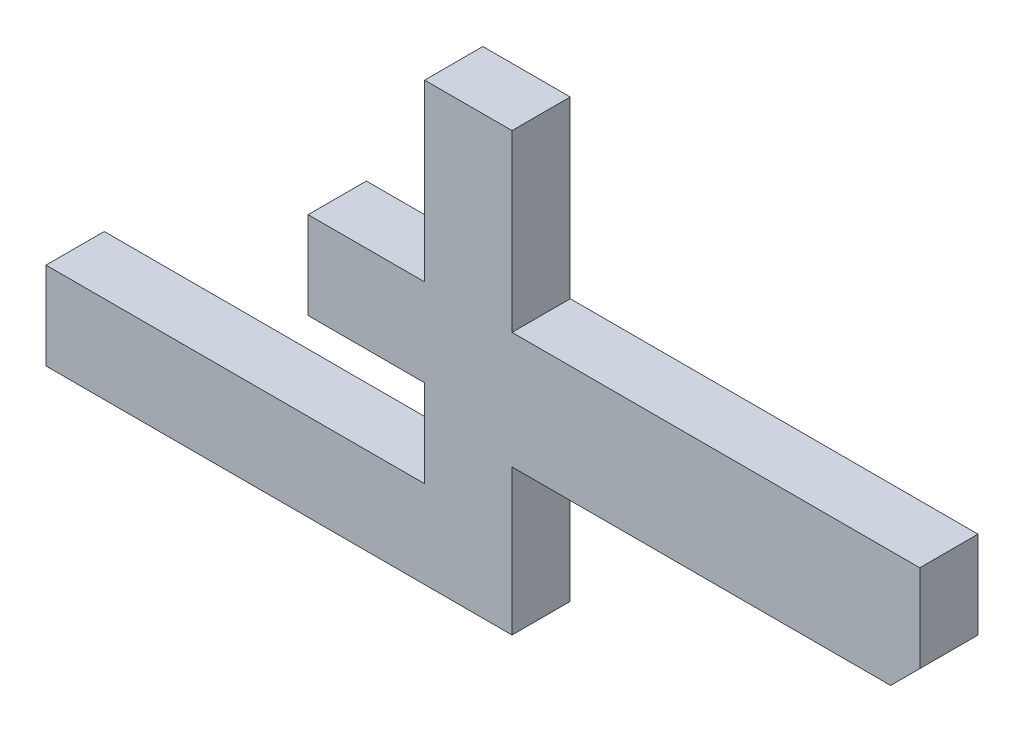
ISO-10303-21;
HEADER;
FILE_DESCRIPTION(('STEP AP214'),'2;1');
FILE_NAME('part.step','',(''),(''),'','','');
FILE_SCHEMA(('AUTOMOTIVE_DESIGN { 1 0 10303 214 1 1 1 1 }'));
ENDSEC;
DATA;
#1=APPLICATION_CONTEXT('core data for automotive mechanical design processes');
#2=APPLICATION_PROTOCOL_DEFINITION('international standard','automotive_design',2000,#1);
#3=PRODUCT_CONTEXT('',#1,'mechanical');
#4=PRODUCT('Part','Part','',(#3));
#5=PRODUCT_RELATED_PRODUCT_CATEGORY('part','',(#4));
#6=PRODUCT_DEFINITION_FORMATION('','',#4);
#7=PRODUCT_DEFINITION_CONTEXT('part definition',#1,'design');
#8=PRODUCT_DEFINITION('design','',#6,#7);
#9=PRODUCT_DEFINITION_SHAPE('','',#8);
#10=(LENGTH_UNIT() NAMED_UNIT(*) SI_UNIT(.MILLI.,.METRE.));
#11=(NAMED_UNIT(*) PLANE_ANGLE_UNIT() SI_UNIT($,.RADIAN.));
#12=(NAMED_UNIT(*) SI_UNIT($,.STERADIAN.) SOLID_ANGLE_UNIT());
#13=UNCERTAINTY_MEASURE_WITH_UNIT(LENGTH_MEASURE(1.E-05),#10,'distance_accuracy_value','');
#14=(GEOMETRIC_REPRESENTATION_CONTEXT(3) GLOBAL_UNCERTAINTY_ASSIGNED_CONTEXT((#13)) GLOBAL_UNIT_ASSIGNED_CONTEXT((#10,
#11,#12)) REPRESENTATION_CONTEXT('',''));
#15=CARTESIAN_POINT('',(0.,0.,0.));
#16=DIRECTION('',(0.,0.,1.));
#17=DIRECTION('',(1.,0.,0.));
#18=AXIS2_PLACEMENT_3D('',#15,#16,#17);
#19=CARTESIAN_POINT('',(-0.1905,-0.09525000000002,0.0254));
#20=DIRECTION('',(0.,0.,1.));
#21=DIRECTION('',(1.,0.,0.));
#22=AXIS2_PLACEMENT_3D('',#19,#20,#21);
#23=PLANE('',#22);
#24=DIRECTION('',(1.,0.,0.));
#25=VECTOR('',#24,1.);
#26=CARTESIAN_POINT('',(-0.1905,-0.05715000000001,0.0254));
#27=LINE('',#26,#25);
#28=CARTESIAN_POINT('',(-0.1905,-0.05715000000001,0.0254));
#29=VERTEX_POINT('',#28);
#30=CARTESIAN_POINT('',(-0.0254,-0.05715000000001,0.0254));
#31=VERTEX_POINT('',#30);
#32=EDGE_CURVE('E187',#29,#31,#27,.T.);
#33=ORIENTED_EDGE('',*,*,#32,.F.);
#34=DIRECTION('',(0.,1.,0.));
#35=VECTOR('',#34,1.);
#36=CARTESIAN_POINT('',(-0.1905,-0.09525000000002,0.0254));
#37=LINE('',#36,#35);
#38=CARTESIAN_POINT('',(-0.1905,-0.09525000000002,0.0254));
#39=VERTEX_POINT('',#38);
#40=EDGE_CURVE('E136',#39,#29,#37,.T.);
#41=ORIENTED_EDGE('',*,*,#40,.F.);
#42=DIRECTION('',(1.,0.,0.));
#43=VECTOR('',#42,1.);
#44=CARTESIAN_POINT('',(0.0127,-0.09525000000002,0.0254));
#45=LINE('',#44,#43);
#46=CARTESIAN_POINT('',(0.0127,-0.09525000000002,0.0254));
#47=VERTEX_POINT('',#46);
#48=EDGE_CURVE('E20',#47,#39,#45,.F.);
#49=ORIENTED_EDGE('',*,*,#48,.F.);
#50=DIRECTION('',(0.,1.,0.));
#51=VECTOR('',#50,1.);
#52=CARTESIAN_POINT('',(0.0127,-0.03175000000002,0.0254));
#53=LINE('',#52,#51);
#54=CARTESIAN_POINT('',(0.0127,-0.03175000000002,0.0254));
#55=VERTEX_POINT('',#54);
#56=EDGE_CURVE('E125',#55,#47,#53,.F.);
#57=ORIENTED_EDGE('',*,*,#56,.F.);
#58=DIRECTION('',(1.,0.,0.));
#59=VECTOR('',#58,1.);
#60=CARTESIAN_POINT('',(0.1778,-0.03175000000002,0.0254));
#61=LINE('',#60,#59);
#62=CARTESIAN_POINT('',(0.1778,-0.03175000000002,0.0254));
#63=VERTEX_POINT('',#62);
#64=EDGE_CURVE('E120',#63,#55,#61,.F.);
#65=ORIENTED_EDGE('',*,*,#64,.F.);
#66=DIRECTION('',(0.707106781186548,0.707106781186548,0.));
#67=VECTOR('',#66,1.);
#68=CARTESIAN_POINT('',(0.1905,-0.01905000000002,0.0254));
#69=LINE('',#68,#67);
#70=CARTESIAN_POINT('',(0.1905,-0.01905000000002,0.0254));
#71=VERTEX_POINT('',#70);
#72=EDGE_CURVE('E147',#71,#63,#69,.F.);
#73=ORIENTED_EDGE('',*,*,#72,.F.);
#74=DIRECTION('',(0.,1.,0.));
#75=VECTOR('',#74,1.);
#76=CARTESIAN_POINT('',(0.1905,0.01904999999999,0.0254));
#77=LINE('',#76,#75);
#78=CARTESIAN_POINT('',(0.1905,0.01904999999999,0.0254));
#79=VERTEX_POINT('',#78);
#80=EDGE_CURVE('E151',#79,#71,#77,.F.);
#81=ORIENTED_EDGE('',*,*,#80,.F.);
#82=DIRECTION('',(1.,0.,0.));
#83=VECTOR('',#82,1.);
#84=CARTESIAN_POINT('',(0.0127,0.01904999999999,0.0254));
#85=LINE('',#84,#83);
#86=CARTESIAN_POINT('',(0.0127,0.01904999999999,0.0254));
#87=VERTEX_POINT('',#86);
#88=EDGE_CURVE('E155',#87,#79,#85,.T.);
#89=ORIENTED_EDGE('',*,*,#88,.F.);
#90=DIRECTION('',(0.,1.,0.));
#91=VECTOR('',#90,1.);
#92=CARTESIAN_POINT('',(0.0127,0.09524999999999,0.0254));
#93=LINE('',#92,#91);
#94=CARTESIAN_POINT('',(0.0127,0.09524999999999,0.0254));
#95=VERTEX_POINT('',#94);
#96=EDGE_CURVE('E159',#95,#87,#93,.F.);
#97=ORIENTED_EDGE('',*,*,#96,.F.);
#98=DIRECTION('',(1.,0.,0.));
#99=VECTOR('',#98,1.);
#100=CARTESIAN_POINT('',(-0.0254,0.09524999999999,0.0254));
#101=LINE('',#100,#99);
#102=CARTESIAN_POINT('',(-0.0254,0.09524999999999,0.0254));
#103=VERTEX_POINT('',#102);
#104=EDGE_CURVE('E163',#103,#95,#101,.T.);
#105=ORIENTED_EDGE('',*,*,#104,.F.);
#106=DIRECTION('',(0.,1.,0.));
#107=VECTOR('',#106,1.);
#108=CARTESIAN_POINT('',(-0.0254,0.01904999999999,0.0254));
#109=LINE('',#108,#107);
#110=CARTESIAN_POINT('',(-0.0254,0.01904999999999,0.0254));
#111=VERTEX_POINT('',#110);
#112=EDGE_CURVE('E167',#111,#103,#109,.T.);
#113=ORIENTED_EDGE('',*,*,#112,.F.);
#114=DIRECTION('',(1.,0.,0.));
#115=VECTOR('',#114,1.);
#116=CARTESIAN_POINT('',(-0.0762,0.01904999999999,0.0254));
#117=LINE('',#116,#115);
#118=CARTESIAN_POINT('',(-0.0762,0.01904999999999,0.0254));
#119=VERTEX_POINT('',#118);
#120=EDGE_CURVE('E171',#119,#111,#117,.T.);
#121=ORIENTED_EDGE('',*,*,#120,.F.);
#122=DIRECTION('',(0.,1.,0.));
#123=VECTOR('',#122,1.);
#124=CARTESIAN_POINT('',(-0.0762,-0.01905000000002,0.0254));
#125=LINE('',#124,#123);
#126=CARTESIAN_POINT('',(-0.0762,-0.01905000000002,0.0254));
#127=VERTEX_POINT('',#126);
#128=EDGE_CURVE('E175',#127,#119,#125,.T.);
#129=ORIENTED_EDGE('',*,*,#128,.F.);
#130=DIRECTION('',(1.,0.,0.));
#131=VECTOR('',#130,1.);
#132=CARTESIAN_POINT('',(-0.0254,-0.01905000000002,0.0254));
#133=LINE('',#132,#131);
#134=CARTESIAN_POINT('',(-0.0254,-0.01905000000002,0.0254));
#135=VERTEX_POINT('',#134);
#136=EDGE_CURVE('E179',#135,#127,#133,.F.);
#137=ORIENTED_EDGE('',*,*,#136,.F.);
#138=DIRECTION('',(0.,1.,0.));
#139=VECTOR('',#138,1.);
#140=CARTESIAN_POINT('',(-0.0254,-0.05715000000001,0.0254));
#141=LINE('',#140,#139);
#142=EDGE_CURVE('E183',#31,#135,#141,.T.);
#143=ORIENTED_EDGE('',*,*,#142,.F.);
#144=EDGE_LOOP('',(#33,#41,#49,#57,#65,#73,#81,#89,#97,#105,#113,#121,#129,#137,#143));
#145=FACE_BOUND('',#144,.T.);
#146=ADVANCED_FACE('F17',(#145),#23,.T.);
#147=CARTESIAN_POINT('',(0.0127,-0.09525000000002,0.));
#148=DIRECTION('',(0.,-1.,0.));
#149=DIRECTION('',(0.,0.,-1.));
#150=AXIS2_PLACEMENT_3D('',#147,#148,#149);
#151=PLANE('',#150);
#152=DIRECTION('',(0.,0.,1.));
#153=VECTOR('',#152,1.);
#154=CARTESIAN_POINT('',(-0.1905,-0.09525000000002,0.));
#155=LINE('',#154,#153);
#156=CARTESIAN_POINT('',(-0.1905,-0.09525000000002,0.));
#157=VERTEX_POINT('',#156);
#158=EDGE_CURVE('E191',#157,#39,#155,.T.);
#159=ORIENTED_EDGE('',*,*,#158,.F.);
#160=DIRECTION('',(1.,0.,0.));
#161=VECTOR('',#160,1.);
#162=CARTESIAN_POINT('',(-0.1905,-0.09525000000002,0.));
#163=LINE('',#162,#161);
#164=CARTESIAN_POINT('',(0.0127,-0.09525000000002,0.));
#165=VERTEX_POINT('',#164);
#166=EDGE_CURVE('E142',#157,#165,#163,.T.);
#167=ORIENTED_EDGE('',*,*,#166,.T.);
#168=DIRECTION('',(0.,0.,-1.));
#169=VECTOR('',#168,1.);
#170=CARTESIAN_POINT('',(0.0127,-0.09525000000002,0.));
#171=LINE('',#170,#169);
#172=EDGE_CURVE('E130',#47,#165,#171,.T.);
#173=ORIENTED_EDGE('',*,*,#172,.F.);
#174=ORIENTED_EDGE('',*,*,#48,.T.);
#175=EDGE_LOOP('',(#159,#167,#173,#174));
#176=FACE_BOUND('',#175,.T.);
#177=ADVANCED_FACE('F141',(#176),#151,.T.);
#178=CARTESIAN_POINT('',(0.0127,-0.03175000000002,0.));
#179=DIRECTION('',(1.,0.,0.));
#180=DIRECTION('',(0.,0.,-1.));
#181=AXIS2_PLACEMENT_3D('',#178,#179,#180);
#182=PLANE('',#181);
#183=ORIENTED_EDGE('',*,*,#172,.T.);
#184=DIRECTION('',(0.,1.,0.));
#185=VECTOR('',#184,1.);
#186=CARTESIAN_POINT('',(0.0127,-0.09525000000002,0.));
#187=LINE('',#186,#185);
#188=CARTESIAN_POINT('',(0.0127,-0.03175000000002,0.));
#189=VERTEX_POINT('',#188);
#190=EDGE_CURVE('E196',#165,#189,#187,.T.);
#191=ORIENTED_EDGE('',*,*,#190,.T.);
#192=DIRECTION('',(0.,0.,-1.));
#193=VECTOR('',#192,1.);
#194=CARTESIAN_POINT('',(0.0127,-0.03175000000002,0.));
#195=LINE('',#194,#193);
#196=EDGE_CURVE('E132',#55,#189,#195,.T.);
#197=ORIENTED_EDGE('',*,*,#196,.F.);
#198=ORIENTED_EDGE('',*,*,#56,.T.);
#199=EDGE_LOOP('',(#183,#191,#197,#198));
#200=FACE_BOUND('',#199,.T.);
#201=ADVANCED_FACE('F127',(#200),#182,.T.);
#202=CARTESIAN_POINT('',(0.1778,-0.03175000000002,0.));
#203=DIRECTION('',(0.,-1.,0.));
#204=DIRECTION('',(0.,0.,-1.));
#205=AXIS2_PLACEMENT_3D('',#202,#203,#204);
#206=PLANE('',#205);
#207=ORIENTED_EDGE('',*,*,#196,.T.);
#208=DIRECTION('',(1.,0.,0.));
#209=VECTOR('',#208,1.);
#210=CARTESIAN_POINT('',(-0.1905,-0.03175000000002,0.));
#211=LINE('',#210,#209);
#212=CARTESIAN_POINT('',(0.1778,-0.03175000000002,0.));
#213=VERTEX_POINT('',#212);
#214=EDGE_CURVE('E198',#189,#213,#211,.T.);
#215=ORIENTED_EDGE('',*,*,#214,.T.);
#216=DIRECTION('',(0.,0.,1.));
#217=VECTOR('',#216,1.);
#218=CARTESIAN_POINT('',(0.1778,-0.03175000000002,0.));
#219=LINE('',#218,#217);
#220=EDGE_CURVE('E149',#63,#213,#219,.F.);
#221=ORIENTED_EDGE('',*,*,#220,.F.);
#222=ORIENTED_EDGE('',*,*,#64,.T.);
#223=EDGE_LOOP('',(#207,#215,#221,#222));
#224=FACE_BOUND('',#223,.T.);
#225=ADVANCED_FACE('F288',(#224),#206,.T.);
#226=CARTESIAN_POINT('',(0.1905,-0.01905000000002,0.));
#227=DIRECTION('',(0.707106781186548,-0.707106781186548,0.));
#228=DIRECTION('',(0.707106781186548,0.707106781186548,0.));
#229=AXIS2_PLACEMENT_3D('',#226,#227,#228);
#230=PLANE('',#229);
#231=ORIENTED_EDGE('',*,*,#220,.T.);
#232=DIRECTION('',(0.707106781186547,0.707106781186548,0.));
#233=VECTOR('',#232,1.);
#234=CARTESIAN_POINT('',(0.1778,-0.03175000000002,0.));
#235=LINE('',#234,#233);
#236=CARTESIAN_POINT('',(0.1905,-0.01905000000002,0.));
#237=VERTEX_POINT('',#236);
#238=EDGE_CURVE('E201',#213,#237,#235,.T.);
#239=ORIENTED_EDGE('',*,*,#238,.T.);
#240=DIRECTION('',(0.,0.,-1.));
#241=VECTOR('',#240,1.);
#242=CARTESIAN_POINT('',(0.1905,-0.01905000000002,0.));
#243=LINE('',#242,#241);
#244=EDGE_CURVE('E153',#71,#237,#243,.T.);
#245=ORIENTED_EDGE('',*,*,#244,.F.);
#246=ORIENTED_EDGE('',*,*,#72,.T.);
#247=EDGE_LOOP('',(#231,#239,#245,#246));
#248=FACE_BOUND('',#247,.T.);
#249=ADVANCED_FACE('F286',(#248),#230,.T.);
#250=CARTESIAN_POINT('',(0.1905,0.01904999999999,0.));
#251=DIRECTION('',(1.,0.,0.));
#252=DIRECTION('',(0.,0.,-1.));
#253=AXIS2_PLACEMENT_3D('',#250,#251,#252);
#254=PLANE('',#253);
#255=ORIENTED_EDGE('',*,*,#244,.T.);
#256=DIRECTION('',(0.,1.,0.));
#257=VECTOR('',#256,1.);
#258=CARTESIAN_POINT('',(0.1905,-0.09525000000002,0.));
#259=LINE('',#258,#257);
#260=CARTESIAN_POINT('',(0.1905,0.01904999999999,0.));
#261=VERTEX_POINT('',#260);
#262=EDGE_CURVE('E204',#237,#261,#259,.T.);
#263=ORIENTED_EDGE('',*,*,#262,.T.);
#264=DIRECTION('',(0.,0.,1.));
#265=VECTOR('',#264,1.);
#266=CARTESIAN_POINT('',(0.1905,0.01904999999999,0.));
#267=LINE('',#266,#265);
#268=EDGE_CURVE('E157',#79,#261,#267,.F.);
#269=ORIENTED_EDGE('',*,*,#268,.F.);
#270=ORIENTED_EDGE('',*,*,#80,.T.);
#271=EDGE_LOOP('',(#255,#263,#269,#270));
#272=FACE_BOUND('',#271,.T.);
#273=ADVANCED_FACE('F282',(#272),#254,.T.);
#274=CARTESIAN_POINT('',(0.0127,0.01904999999999,0.));
#275=DIRECTION('',(0.,1.,0.));
#276=DIRECTION('',(0.,0.,1.));
#277=AXIS2_PLACEMENT_3D('',#274,#275,#276);
#278=PLANE('',#277);
#279=ORIENTED_EDGE('',*,*,#268,.T.);
#280=DIRECTION('',(1.,0.,0.));
#281=VECTOR('',#280,1.);
#282=CARTESIAN_POINT('',(-0.1905,0.01904999999999,0.));
#283=LINE('',#282,#281);
#284=CARTESIAN_POINT('',(0.0127,0.01904999999999,0.));
#285=VERTEX_POINT('',#284);
#286=EDGE_CURVE('E207',#261,#285,#283,.F.);
#287=ORIENTED_EDGE('',*,*,#286,.T.);
#288=DIRECTION('',(0.,0.,-1.));
#289=VECTOR('',#288,1.);
#290=CARTESIAN_POINT('',(0.0127,0.01904999999999,0.));
#291=LINE('',#290,#289);
#292=EDGE_CURVE('E161',#87,#285,#291,.T.);
#293=ORIENTED_EDGE('',*,*,#292,.F.);
#294=ORIENTED_EDGE('',*,*,#88,.T.);
#295=EDGE_LOOP('',(#279,#287,#293,#294));
#296=FACE_BOUND('',#295,.T.);
#297=ADVANCED_FACE('F276',(#296),#278,.T.);
#298=CARTESIAN_POINT('',(0.0127,0.09524999999999,0.));
#299=DIRECTION('',(1.,0.,0.));
#300=DIRECTION('',(0.,0.,-1.));
#301=AXIS2_PLACEMENT_3D('',#298,#299,#300);
#302=PLANE('',#301);
#303=ORIENTED_EDGE('',*,*,#292,.T.);
#304=DIRECTION('',(0.,1.,0.));
#305=VECTOR('',#304,1.);
#306=CARTESIAN_POINT('',(0.0127,-0.09525000000002,0.));
#307=LINE('',#306,#305);
#308=CARTESIAN_POINT('',(0.0127,0.09524999999999,0.));
#309=VERTEX_POINT('',#308);
#310=EDGE_CURVE('E210',#285,#309,#307,.T.);
#311=ORIENTED_EDGE('',*,*,#310,.T.);
#312=DIRECTION('',(0.,0.,1.));
#313=VECTOR('',#312,1.);
#314=CARTESIAN_POINT('',(0.0127,0.09524999999999,0.));
#315=LINE('',#314,#313);
#316=EDGE_CURVE('E165',#95,#309,#315,.F.);
#317=ORIENTED_EDGE('',*,*,#316,.F.);
#318=ORIENTED_EDGE('',*,*,#96,.T.);
#319=EDGE_LOOP('',(#303,#311,#317,#318));
#320=FACE_BOUND('',#319,.T.);
#321=ADVANCED_FACE('F272',(#320),#302,.T.);
#322=CARTESIAN_POINT('',(-0.0254,0.09524999999999,0.));
#323=DIRECTION('',(0.,1.,0.));
#324=DIRECTION('',(0.,0.,1.));
#325=AXIS2_PLACEMENT_3D('',#322,#323,#324);
#326=PLANE('',#325);
#327=ORIENTED_EDGE('',*,*,#316,.T.);
#328=DIRECTION('',(1.,0.,0.));
#329=VECTOR('',#328,1.);
#330=CARTESIAN_POINT('',(-0.1905,0.09524999999999,0.));
#331=LINE('',#330,#329);
#332=CARTESIAN_POINT('',(-0.0254,0.09524999999999,0.));
#333=VERTEX_POINT('',#332);
#334=EDGE_CURVE('E213',#309,#333,#331,.F.);
#335=ORIENTED_EDGE('',*,*,#334,.T.);
#336=DIRECTION('',(0.,0.,1.));
#337=VECTOR('',#336,1.);
#338=CARTESIAN_POINT('',(-0.0254,0.09524999999999,0.));
#339=LINE('',#338,#337);
#340=EDGE_CURVE('E169',#103,#333,#339,.F.);
#341=ORIENTED_EDGE('',*,*,#340,.F.);
#342=ORIENTED_EDGE('',*,*,#104,.T.);
#343=EDGE_LOOP('',(#327,#335,#341,#342));
#344=FACE_BOUND('',#343,.T.);
#345=ADVANCED_FACE('F266',(#344),#326,.T.);
#346=CARTESIAN_POINT('',(-0.0254,0.01904999999999,0.));
#347=DIRECTION('',(-1.,0.,0.));
#348=DIRECTION('',(0.,0.,1.));
#349=AXIS2_PLACEMENT_3D('',#346,#347,#348);
#350=PLANE('',#349);
#351=ORIENTED_EDGE('',*,*,#340,.T.);
#352=DIRECTION('',(0.,1.,0.));
#353=VECTOR('',#352,1.);
#354=CARTESIAN_POINT('',(-0.0254,-0.09525000000002,0.));
#355=LINE('',#354,#353);
#356=CARTESIAN_POINT('',(-0.0254,0.01904999999999,0.));
#357=VERTEX_POINT('',#356);
#358=EDGE_CURVE('E216',#333,#357,#355,.F.);
#359=ORIENTED_EDGE('',*,*,#358,.T.);
#360=DIRECTION('',(0.,0.,1.));
#361=VECTOR('',#360,1.);
#362=CARTESIAN_POINT('',(-0.0254,0.01904999999999,0.));
#363=LINE('',#362,#361);
#364=EDGE_CURVE('E173',#111,#357,#363,.F.);
#365=ORIENTED_EDGE('',*,*,#364,.F.);
#366=ORIENTED_EDGE('',*,*,#112,.T.);
#367=EDGE_LOOP('',(#351,#359,#365,#366));
#368=FACE_BOUND('',#367,.T.);
#369=ADVANCED_FACE('F262',(#368),#350,.T.);
#370=CARTESIAN_POINT('',(-0.0762,0.01904999999999,0.));
#371=DIRECTION('',(0.,1.,0.));
#372=DIRECTION('',(0.,0.,1.));
#373=AXIS2_PLACEMENT_3D('',#370,#371,#372);
#374=PLANE('',#373);
#375=ORIENTED_EDGE('',*,*,#364,.T.);
#376=DIRECTION('',(1.,0.,0.));
#377=VECTOR('',#376,1.);
#378=CARTESIAN_POINT('',(-0.1905,0.01904999999999,0.));
#379=LINE('',#378,#377);
#380=CARTESIAN_POINT('',(-0.0762,0.01904999999999,0.));
#381=VERTEX_POINT('',#380);
#382=EDGE_CURVE('E219',#357,#381,#379,.F.);
#383=ORIENTED_EDGE('',*,*,#382,.T.);
#384=DIRECTION('',(0.,0.,1.));
#385=VECTOR('',#384,1.);
#386=CARTESIAN_POINT('',(-0.0762,0.01904999999999,0.));
#387=LINE('',#386,#385);
#388=EDGE_CURVE('E177',#119,#381,#387,.F.);
#389=ORIENTED_EDGE('',*,*,#388,.F.);
#390=ORIENTED_EDGE('',*,*,#120,.T.);
#391=EDGE_LOOP('',(#375,#383,#389,#390));
#392=FACE_BOUND('',#391,.T.);
#393=ADVANCED_FACE('F256',(#392),#374,.T.);
#394=CARTESIAN_POINT('',(-0.0762,-0.01905000000002,0.));
#395=DIRECTION('',(-1.,0.,0.));
#396=DIRECTION('',(0.,0.,1.));
#397=AXIS2_PLACEMENT_3D('',#394,#395,#396);
#398=PLANE('',#397);
#399=ORIENTED_EDGE('',*,*,#388,.T.);
#400=DIRECTION('',(0.,1.,0.));
#401=VECTOR('',#400,1.);
#402=CARTESIAN_POINT('',(-0.0762,-0.09525000000002,0.));
#403=LINE('',#402,#401);
#404=CARTESIAN_POINT('',(-0.0762,-0.01905000000002,0.));
#405=VERTEX_POINT('',#404);
#406=EDGE_CURVE('E222',#381,#405,#403,.F.);
#407=ORIENTED_EDGE('',*,*,#406,.T.);
#408=DIRECTION('',(0.,0.,-1.));
#409=VECTOR('',#408,1.);
#410=CARTESIAN_POINT('',(-0.0762,-0.01905000000002,0.));
#411=LINE('',#410,#409);
#412=EDGE_CURVE('E181',#127,#405,#411,.T.);
#413=ORIENTED_EDGE('',*,*,#412,.F.);
#414=ORIENTED_EDGE('',*,*,#128,.T.);
#415=EDGE_LOOP('',(#399,#407,#413,#414));
#416=FACE_BOUND('',#415,.T.);
#417=ADVANCED_FACE('F252',(#416),#398,.T.);
#418=CARTESIAN_POINT('',(-0.0254,-0.01905000000002,0.));
#419=DIRECTION('',(0.,-1.,0.));
#420=DIRECTION('',(0.,0.,-1.));
#421=AXIS2_PLACEMENT_3D('',#418,#419,#420);
#422=PLANE('',#421);
#423=ORIENTED_EDGE('',*,*,#412,.T.);
#424=DIRECTION('',(1.,0.,0.));
#425=VECTOR('',#424,1.);
#426=CARTESIAN_POINT('',(-0.1905,-0.01905000000002,0.));
#427=LINE('',#426,#425);
#428=CARTESIAN_POINT('',(-0.0254,-0.01905000000002,0.));
#429=VERTEX_POINT('',#428);
#430=EDGE_CURVE('E225',#405,#429,#427,.T.);
#431=ORIENTED_EDGE('',*,*,#430,.T.);
#432=DIRECTION('',(0.,0.,1.));
#433=VECTOR('',#432,1.);
#434=CARTESIAN_POINT('',(-0.0254,-0.01905000000002,0.));
#435=LINE('',#434,#433);
#436=EDGE_CURVE('E185',#135,#429,#435,.F.);
#437=ORIENTED_EDGE('',*,*,#436,.F.);
#438=ORIENTED_EDGE('',*,*,#136,.T.);
#439=EDGE_LOOP('',(#423,#431,#437,#438));
#440=FACE_BOUND('',#439,.T.);
#441=ADVANCED_FACE('F246',(#440),#422,.T.);
#442=CARTESIAN_POINT('',(-0.0254,-0.05715000000001,0.));
#443=DIRECTION('',(-1.,0.,0.));
#444=DIRECTION('',(0.,0.,1.));
#445=AXIS2_PLACEMENT_3D('',#442,#443,#444);
#446=PLANE('',#445);
#447=ORIENTED_EDGE('',*,*,#436,.T.);
#448=DIRECTION('',(0.,1.,0.));
#449=VECTOR('',#448,1.);
#450=CARTESIAN_POINT('',(-0.0254,-0.09525000000002,0.));
#451=LINE('',#450,#449);
#452=CARTESIAN_POINT('',(-0.0254,-0.05715000000001,0.));
#453=VERTEX_POINT('',#452);
#454=EDGE_CURVE('E228',#429,#453,#451,.F.);
#455=ORIENTED_EDGE('',*,*,#454,.T.);
#456=DIRECTION('',(0.,0.,1.));
#457=VECTOR('',#456,1.);
#458=CARTESIAN_POINT('',(-0.0254,-0.05715000000001,0.));
#459=LINE('',#458,#457);
#460=EDGE_CURVE('E189',#31,#453,#459,.F.);
#461=ORIENTED_EDGE('',*,*,#460,.F.);
#462=ORIENTED_EDGE('',*,*,#142,.T.);
#463=EDGE_LOOP('',(#447,#455,#461,#462));
#464=FACE_BOUND('',#463,.T.);
#465=ADVANCED_FACE('F241',(#464),#446,.T.);
#466=CARTESIAN_POINT('',(-0.1905,-0.05715000000001,0.));
#467=DIRECTION('',(0.,1.,0.));
#468=DIRECTION('',(0.,0.,1.));
#469=AXIS2_PLACEMENT_3D('',#466,#467,#468);
#470=PLANE('',#469);
#471=ORIENTED_EDGE('',*,*,#460,.T.);
#472=DIRECTION('',(1.,0.,0.));
#473=VECTOR('',#472,1.);
#474=CARTESIAN_POINT('',(-0.1905,-0.05715000000001,0.));
#475=LINE('',#474,#473);
#476=CARTESIAN_POINT('',(-0.1905,-0.05715000000001,0.));
#477=VERTEX_POINT('',#476);
#478=EDGE_CURVE('E26',#453,#477,#475,.F.);
#479=ORIENTED_EDGE('',*,*,#478,.T.);
#480=DIRECTION('',(0.,0.,1.));
#481=VECTOR('',#480,1.);
#482=CARTESIAN_POINT('',(-0.1905,-0.05715000000001,0.));
#483=LINE('',#482,#481);
#484=EDGE_CURVE('E34',#29,#477,#483,.F.);
#485=ORIENTED_EDGE('',*,*,#484,.F.);
#486=ORIENTED_EDGE('',*,*,#32,.T.);
#487=EDGE_LOOP('',(#471,#479,#485,#486));
#488=FACE_BOUND('',#487,.T.);
#489=ADVANCED_FACE('F234',(#488),#470,.T.);
#490=CARTESIAN_POINT('',(-0.1905,-0.09525000000002,0.));
#491=DIRECTION('',(-1.,0.,0.));
#492=DIRECTION('',(0.,0.,1.));
#493=AXIS2_PLACEMENT_3D('',#490,#491,#492);
#494=PLANE('',#493);
#495=ORIENTED_EDGE('',*,*,#484,.T.);
#496=DIRECTION('',(0.,1.,0.));
#497=VECTOR('',#496,1.);
#498=CARTESIAN_POINT('',(-0.1905,-0.09525000000002,0.));
#499=LINE('',#498,#497);
#500=EDGE_CURVE('E11',#477,#157,#499,.F.);
#501=ORIENTED_EDGE('',*,*,#500,.T.);
#502=ORIENTED_EDGE('',*,*,#158,.T.);
#503=ORIENTED_EDGE('',*,*,#40,.T.);
#504=EDGE_LOOP('',(#495,#501,#502,#503));
#505=FACE_BOUND('',#504,.T.);
#506=ADVANCED_FACE('F299',(#505),#494,.T.);
#507=CARTESIAN_POINT('',(-0.1905,-0.09525000000002,0.));
#508=DIRECTION('',(0.,0.,1.));
#509=DIRECTION('',(1.,0.,0.));
#510=AXIS2_PLACEMENT_3D('',#507,#508,#509);
#511=PLANE('',#510);
#512=ORIENTED_EDGE('',*,*,#478,.F.);
#513=ORIENTED_EDGE('',*,*,#454,.F.);
#514=ORIENTED_EDGE('',*,*,#430,.F.);
#515=ORIENTED_EDGE('',*,*,#406,.F.);
#516=ORIENTED_EDGE('',*,*,#382,.F.);
#517=ORIENTED_EDGE('',*,*,#358,.F.);
#518=ORIENTED_EDGE('',*,*,#334,.F.);
#519=ORIENTED_EDGE('',*,*,#310,.F.);
#520=ORIENTED_EDGE('',*,*,#286,.F.);
#521=ORIENTED_EDGE('',*,*,#262,.F.);
#522=ORIENTED_EDGE('',*,*,#238,.F.);
#523=ORIENTED_EDGE('',*,*,#214,.F.);
#524=ORIENTED_EDGE('',*,*,#190,.F.);
#525=ORIENTED_EDGE('',*,*,#166,.F.);
#526=ORIENTED_EDGE('',*,*,#500,.F.);
#527=EDGE_LOOP('',(#512,#513,#514,#515,#516,#517,#518,#519,#520,#521,#522,#523,#524,#525,#526));
#528=FACE_BOUND('',#527,.T.);
#529=ADVANCED_FACE('F238',(#528),#511,.F.);
#530=CLOSED_SHELL('',(#146,#177,#201,#225,#249,#273,#297,#321,#345,#369,#393,#417,#441,#465,
#489,#506,#529));
#531=MANIFOLD_SOLID_BREP('B1',#530);
#532=ADVANCED_BREP_SHAPE_REPRESENTATION('',(#18,#531),#14);
#533=SHAPE_DEFINITION_REPRESENTATION(#9,#532);
ENDSEC;
END-ISO-10303-21;
